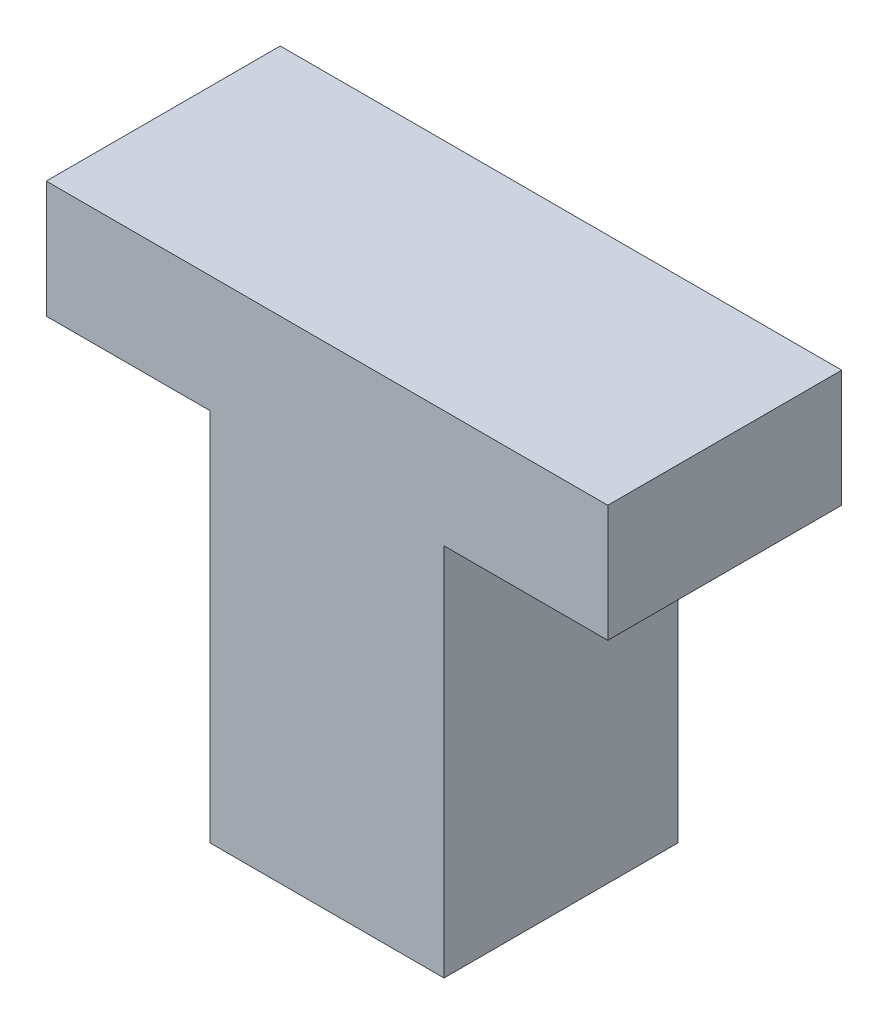
ISO-10303-21;
HEADER;
FILE_DESCRIPTION(('STEP AP214'),'2;1');
FILE_NAME('part.step','',(''),(''),'','','');
FILE_SCHEMA(('AUTOMOTIVE_DESIGN { 1 0 10303 214 1 1 1 1 }'));
ENDSEC;
DATA;
#1=APPLICATION_CONTEXT('core data for automotive mechanical design processes');
#2=APPLICATION_PROTOCOL_DEFINITION('international standard','automotive_design',2000,#1);
#3=PRODUCT_CONTEXT('',#1,'mechanical');
#4=PRODUCT('Part','Part','',(#3));
#5=PRODUCT_RELATED_PRODUCT_CATEGORY('part','',(#4));
#6=PRODUCT_DEFINITION_FORMATION('','',#4);
#7=PRODUCT_DEFINITION_CONTEXT('part definition',#1,'design');
#8=PRODUCT_DEFINITION('design','',#6,#7);
#9=PRODUCT_DEFINITION_SHAPE('','',#8);
#10=(LENGTH_UNIT() NAMED_UNIT(*) SI_UNIT(.MILLI.,.METRE.));
#11=(NAMED_UNIT(*) PLANE_ANGLE_UNIT() SI_UNIT($,.RADIAN.));
#12=(NAMED_UNIT(*) SI_UNIT($,.STERADIAN.) SOLID_ANGLE_UNIT());
#13=UNCERTAINTY_MEASURE_WITH_UNIT(LENGTH_MEASURE(1.E-05),#10,'distance_accuracy_value','');
#14=(GEOMETRIC_REPRESENTATION_CONTEXT(3) GLOBAL_UNCERTAINTY_ASSIGNED_CONTEXT((#13)) GLOBAL_UNIT_ASSIGNED_CONTEXT((#10,
#11,#12)) REPRESENTATION_CONTEXT('',''));
#15=CARTESIAN_POINT('',(0.,0.,0.));
#16=DIRECTION('',(0.,0.,1.));
#17=DIRECTION('',(1.,0.,0.));
#18=AXIS2_PLACEMENT_3D('',#15,#16,#17);
#19=CARTESIAN_POINT('',(5.,0.,5.));
#20=DIRECTION('',(0.,1.,0.));
#21=DIRECTION('',(-1.,0.,0.));
#22=AXIS2_PLACEMENT_3D('',#19,#20,#21);
#23=PLANE('',#22);
#24=DIRECTION('',(1.,0.,0.));
#25=VECTOR('',#24,1.);
#26=CARTESIAN_POINT('',(5.,0.,0.));
#27=LINE('',#26,#25);
#28=CARTESIAN_POINT('',(0.,0.,0.));
#29=VERTEX_POINT('',#28);
#30=CARTESIAN_POINT('',(5.,0.,0.));
#31=VERTEX_POINT('',#30);
#32=EDGE_CURVE('E128',#29,#31,#27,.T.);
#33=ORIENTED_EDGE('',*,*,#32,.T.);
#34=DIRECTION('',(0.,0.,-1.));
#35=VECTOR('',#34,1.);
#36=CARTESIAN_POINT('',(5.,0.,5.));
#37=LINE('',#36,#35);
#38=CARTESIAN_POINT('',(5.,0.,5.));
#39=VERTEX_POINT('',#38);
#40=EDGE_CURVE('E11',#39,#31,#37,.T.);
#41=ORIENTED_EDGE('',*,*,#40,.F.);
#42=DIRECTION('',(1.,0.,0.));
#43=VECTOR('',#42,1.);
#44=CARTESIAN_POINT('',(5.,0.,5.));
#45=LINE('',#44,#43);
#46=CARTESIAN_POINT('',(0.,0.,5.));
#47=VERTEX_POINT('',#46);
#48=EDGE_CURVE('E142',#47,#39,#45,.T.);
#49=ORIENTED_EDGE('',*,*,#48,.F.);
#50=DIRECTION('',(0.,0.,-1.));
#51=VECTOR('',#50,1.);
#52=CARTESIAN_POINT('',(0.,0.,5.));
#53=LINE('',#52,#51);
#54=EDGE_CURVE('E124',#47,#29,#53,.T.);
#55=ORIENTED_EDGE('',*,*,#54,.T.);
#56=EDGE_LOOP('',(#33,#41,#49,#55));
#57=FACE_BOUND('',#56,.T.);
#58=ADVANCED_FACE('F32',(#57),#23,.F.);
#59=CARTESIAN_POINT('',(5.,8.,5.));
#60=DIRECTION('',(-1.,0.,0.));
#61=DIRECTION('',(0.,-1.,0.));
#62=AXIS2_PLACEMENT_3D('',#59,#60,#61);
#63=PLANE('',#62);
#64=DIRECTION('',(0.,1.,0.));
#65=VECTOR('',#64,1.);
#66=CARTESIAN_POINT('',(5.,8.,0.));
#67=LINE('',#66,#65);
#68=CARTESIAN_POINT('',(5.,8.,0.));
#69=VERTEX_POINT('',#68);
#70=EDGE_CURVE('E131',#31,#69,#67,.T.);
#71=ORIENTED_EDGE('',*,*,#70,.T.);
#72=DIRECTION('',(0.,0.,-1.));
#73=VECTOR('',#72,1.);
#74=CARTESIAN_POINT('',(5.,8.,5.));
#75=LINE('',#74,#73);
#76=CARTESIAN_POINT('',(5.,8.,5.));
#77=VERTEX_POINT('',#76);
#78=EDGE_CURVE('E40',#77,#69,#75,.T.);
#79=ORIENTED_EDGE('',*,*,#78,.F.);
#80=DIRECTION('',(0.,1.,0.));
#81=VECTOR('',#80,1.);
#82=CARTESIAN_POINT('',(5.,8.,5.));
#83=LINE('',#82,#81);
#84=EDGE_CURVE('E91',#39,#77,#83,.T.);
#85=ORIENTED_EDGE('',*,*,#84,.F.);
#86=ORIENTED_EDGE('',*,*,#40,.T.);
#87=EDGE_LOOP('',(#71,#79,#85,#86));
#88=FACE_BOUND('',#87,.T.);
#89=ADVANCED_FACE('F177',(#88),#63,.F.);
#90=CARTESIAN_POINT('',(8.5,8.,5.));
#91=DIRECTION('',(0.,1.,0.));
#92=DIRECTION('',(-1.,0.,0.));
#93=AXIS2_PLACEMENT_3D('',#90,#91,#92);
#94=PLANE('',#93);
#95=DIRECTION('',(1.,0.,0.));
#96=VECTOR('',#95,1.);
#97=CARTESIAN_POINT('',(8.5,8.,0.));
#98=LINE('',#97,#96);
#99=CARTESIAN_POINT('',(8.5,8.,0.));
#100=VERTEX_POINT('',#99);
#101=EDGE_CURVE('E133',#69,#100,#98,.T.);
#102=ORIENTED_EDGE('',*,*,#101,.T.);
#103=DIRECTION('',(0.,0.,-1.));
#104=VECTOR('',#103,1.);
#105=CARTESIAN_POINT('',(8.5,8.,5.));
#106=LINE('',#105,#104);
#107=CARTESIAN_POINT('',(8.5,8.,5.));
#108=VERTEX_POINT('',#107);
#109=EDGE_CURVE('E149',#108,#100,#106,.T.);
#110=ORIENTED_EDGE('',*,*,#109,.F.);
#111=DIRECTION('',(1.,0.,0.));
#112=VECTOR('',#111,1.);
#113=CARTESIAN_POINT('',(8.5,8.,5.));
#114=LINE('',#113,#112);
#115=EDGE_CURVE('E157',#77,#108,#114,.T.);
#116=ORIENTED_EDGE('',*,*,#115,.F.);
#117=ORIENTED_EDGE('',*,*,#78,.T.);
#118=EDGE_LOOP('',(#102,#110,#116,#117));
#119=FACE_BOUND('',#118,.T.);
#120=ADVANCED_FACE('F155',(#119),#94,.F.);
#121=CARTESIAN_POINT('',(8.5,10.5,5.));
#122=DIRECTION('',(-1.,0.,0.));
#123=DIRECTION('',(0.,-1.,0.));
#124=AXIS2_PLACEMENT_3D('',#121,#122,#123);
#125=PLANE('',#124);
#126=DIRECTION('',(0.,1.,0.));
#127=VECTOR('',#126,1.);
#128=CARTESIAN_POINT('',(8.5,10.5,0.));
#129=LINE('',#128,#127);
#130=CARTESIAN_POINT('',(8.5,10.5,0.));
#131=VERTEX_POINT('',#130);
#132=EDGE_CURVE('E135',#100,#131,#129,.T.);
#133=ORIENTED_EDGE('',*,*,#132,.T.);
#134=DIRECTION('',(0.,0.,-1.));
#135=VECTOR('',#134,1.);
#136=CARTESIAN_POINT('',(8.5,10.5,5.));
#137=LINE('',#136,#135);
#138=CARTESIAN_POINT('',(8.5,10.5,5.));
#139=VERTEX_POINT('',#138);
#140=EDGE_CURVE('E146',#139,#131,#137,.T.);
#141=ORIENTED_EDGE('',*,*,#140,.F.);
#142=DIRECTION('',(0.,1.,0.));
#143=VECTOR('',#142,1.);
#144=CARTESIAN_POINT('',(8.5,10.5,5.));
#145=LINE('',#144,#143);
#146=EDGE_CURVE('E169',#108,#139,#145,.T.);
#147=ORIENTED_EDGE('',*,*,#146,.F.);
#148=ORIENTED_EDGE('',*,*,#109,.T.);
#149=EDGE_LOOP('',(#133,#141,#147,#148));
#150=FACE_BOUND('',#149,.T.);
#151=ADVANCED_FACE('F165',(#150),#125,.F.);
#152=CARTESIAN_POINT('',(-3.5,10.5,5.));
#153=DIRECTION('',(0.,-1.,0.));
#154=DIRECTION('',(0.,0.,-1.));
#155=AXIS2_PLACEMENT_3D('',#152,#153,#154);
#156=PLANE('',#155);
#157=DIRECTION('',(-1.,0.,0.));
#158=VECTOR('',#157,1.);
#159=CARTESIAN_POINT('',(-3.5,10.5,0.));
#160=LINE('',#159,#158);
#161=CARTESIAN_POINT('',(-3.5,10.5,0.));
#162=VERTEX_POINT('',#161);
#163=EDGE_CURVE('E137',#131,#162,#160,.T.);
#164=ORIENTED_EDGE('',*,*,#163,.T.);
#165=DIRECTION('',(0.,0.,-1.));
#166=VECTOR('',#165,1.);
#167=CARTESIAN_POINT('',(-3.5,10.5,5.));
#168=LINE('',#167,#166);
#169=CARTESIAN_POINT('',(-3.5,10.5,5.));
#170=VERTEX_POINT('',#169);
#171=EDGE_CURVE('E119',#170,#162,#168,.T.);
#172=ORIENTED_EDGE('',*,*,#171,.F.);
#173=DIRECTION('',(-1.,0.,0.));
#174=VECTOR('',#173,1.);
#175=CARTESIAN_POINT('',(-3.5,10.5,5.));
#176=LINE('',#175,#174);
#177=EDGE_CURVE('E110',#139,#170,#176,.T.);
#178=ORIENTED_EDGE('',*,*,#177,.F.);
#179=ORIENTED_EDGE('',*,*,#140,.T.);
#180=EDGE_LOOP('',(#164,#172,#178,#179));
#181=FACE_BOUND('',#180,.T.);
#182=ADVANCED_FACE('F168',(#181),#156,.F.);
#183=CARTESIAN_POINT('',(-3.5,8.,5.));
#184=DIRECTION('',(1.,0.,0.));
#185=DIRECTION('',(0.,1.,0.));
#186=AXIS2_PLACEMENT_3D('',#183,#184,#185);
#187=PLANE('',#186);
#188=DIRECTION('',(0.,-1.,0.));
#189=VECTOR('',#188,1.);
#190=CARTESIAN_POINT('',(-3.5,8.,0.));
#191=LINE('',#190,#189);
#192=CARTESIAN_POINT('',(-3.5,8.,0.));
#193=VERTEX_POINT('',#192);
#194=EDGE_CURVE('E118',#162,#193,#191,.T.);
#195=ORIENTED_EDGE('',*,*,#194,.T.);
#196=DIRECTION('',(0.,0.,-1.));
#197=VECTOR('',#196,1.);
#198=CARTESIAN_POINT('',(-3.5,8.,5.));
#199=LINE('',#198,#197);
#200=CARTESIAN_POINT('',(-3.5,8.,5.));
#201=VERTEX_POINT('',#200);
#202=EDGE_CURVE('E115',#201,#193,#199,.T.);
#203=ORIENTED_EDGE('',*,*,#202,.F.);
#204=DIRECTION('',(0.,-1.,0.));
#205=VECTOR('',#204,1.);
#206=CARTESIAN_POINT('',(-3.5,8.,5.));
#207=LINE('',#206,#205);
#208=EDGE_CURVE('E104',#170,#201,#207,.T.);
#209=ORIENTED_EDGE('',*,*,#208,.F.);
#210=ORIENTED_EDGE('',*,*,#171,.T.);
#211=EDGE_LOOP('',(#195,#203,#209,#210));
#212=FACE_BOUND('',#211,.T.);
#213=ADVANCED_FACE('F116',(#212),#187,.F.);
#214=CARTESIAN_POINT('',(0.,8.,5.));
#215=DIRECTION('',(0.,1.,0.));
#216=DIRECTION('',(-1.,0.,0.));
#217=AXIS2_PLACEMENT_3D('',#214,#215,#216);
#218=PLANE('',#217);
#219=DIRECTION('',(1.,0.,0.));
#220=VECTOR('',#219,1.);
#221=CARTESIAN_POINT('',(0.,8.,0.));
#222=LINE('',#221,#220);
#223=CARTESIAN_POINT('',(0.,8.,0.));
#224=VERTEX_POINT('',#223);
#225=EDGE_CURVE('E77',#193,#224,#222,.T.);
#226=ORIENTED_EDGE('',*,*,#225,.T.);
#227=DIRECTION('',(0.,0.,-1.));
#228=VECTOR('',#227,1.);
#229=CARTESIAN_POINT('',(0.,8.,5.));
#230=LINE('',#229,#228);
#231=CARTESIAN_POINT('',(0.,8.,5.));
#232=VERTEX_POINT('',#231);
#233=EDGE_CURVE('E120',#232,#224,#230,.T.);
#234=ORIENTED_EDGE('',*,*,#233,.F.);
#235=DIRECTION('',(1.,0.,0.));
#236=VECTOR('',#235,1.);
#237=CARTESIAN_POINT('',(0.,8.,5.));
#238=LINE('',#237,#236);
#239=EDGE_CURVE('E108',#201,#232,#238,.T.);
#240=ORIENTED_EDGE('',*,*,#239,.F.);
#241=ORIENTED_EDGE('',*,*,#202,.T.);
#242=EDGE_LOOP('',(#226,#234,#240,#241));
#243=FACE_BOUND('',#242,.T.);
#244=ADVANCED_FACE('F122',(#243),#218,.F.);
#245=CARTESIAN_POINT('',(0.,0.,5.));
#246=DIRECTION('',(1.,0.,0.));
#247=DIRECTION('',(0.,1.,0.));
#248=AXIS2_PLACEMENT_3D('',#245,#246,#247);
#249=PLANE('',#248);
#250=DIRECTION('',(0.,-1.,0.));
#251=VECTOR('',#250,1.);
#252=CARTESIAN_POINT('',(0.,0.,0.));
#253=LINE('',#252,#251);
#254=EDGE_CURVE('E83',#224,#29,#253,.T.);
#255=ORIENTED_EDGE('',*,*,#254,.T.);
#256=ORIENTED_EDGE('',*,*,#54,.F.);
#257=DIRECTION('',(0.,-1.,0.));
#258=VECTOR('',#257,1.);
#259=CARTESIAN_POINT('',(0.,0.,5.));
#260=LINE('',#259,#258);
#261=EDGE_CURVE('E48',#232,#47,#260,.T.);
#262=ORIENTED_EDGE('',*,*,#261,.F.);
#263=ORIENTED_EDGE('',*,*,#233,.T.);
#264=EDGE_LOOP('',(#255,#256,#262,#263));
#265=FACE_BOUND('',#264,.T.);
#266=ADVANCED_FACE('F193',(#265),#249,.F.);
#267=CARTESIAN_POINT('',(0.,0.,5.));
#268=DIRECTION('',(0.,0.,-1.));
#269=DIRECTION('',(-1.,0.,0.));
#270=AXIS2_PLACEMENT_3D('',#267,#268,#269);
#271=PLANE('',#270);
#272=ORIENTED_EDGE('',*,*,#48,.T.);
#273=ORIENTED_EDGE('',*,*,#84,.T.);
#274=ORIENTED_EDGE('',*,*,#115,.T.);
#275=ORIENTED_EDGE('',*,*,#146,.T.);
#276=ORIENTED_EDGE('',*,*,#177,.T.);
#277=ORIENTED_EDGE('',*,*,#208,.T.);
#278=ORIENTED_EDGE('',*,*,#239,.T.);
#279=ORIENTED_EDGE('',*,*,#261,.T.);
#280=EDGE_LOOP('',(#272,#273,#274,#275,#276,#277,#278,#279));
#281=FACE_BOUND('',#280,.T.);
#282=ADVANCED_FACE('F106',(#281),#271,.F.);
#283=CARTESIAN_POINT('',(0.,0.,0.));
#284=DIRECTION('',(0.,0.,-1.));
#285=DIRECTION('',(-1.,0.,0.));
#286=AXIS2_PLACEMENT_3D('',#283,#284,#285);
#287=PLANE('',#286);
#288=ORIENTED_EDGE('',*,*,#32,.F.);
#289=ORIENTED_EDGE('',*,*,#254,.F.);
#290=ORIENTED_EDGE('',*,*,#225,.F.);
#291=ORIENTED_EDGE('',*,*,#194,.F.);
#292=ORIENTED_EDGE('',*,*,#163,.F.);
#293=ORIENTED_EDGE('',*,*,#132,.F.);
#294=ORIENTED_EDGE('',*,*,#101,.F.);
#295=ORIENTED_EDGE('',*,*,#70,.F.);
#296=EDGE_LOOP('',(#288,#289,#290,#291,#292,#293,#294,#295));
#297=FACE_BOUND('',#296,.T.);
#298=ADVANCED_FACE('F161',(#297),#287,.T.);
#299=CLOSED_SHELL('',(#58,#89,#120,#151,#182,#213,#244,#266,#282,#298));
#300=MANIFOLD_SOLID_BREP('B2',#299);
#301=ADVANCED_BREP_SHAPE_REPRESENTATION('',(#18,#300),#14);
#302=SHAPE_DEFINITION_REPRESENTATION(#9,#301);
ENDSEC;
END-ISO-10303-21;
